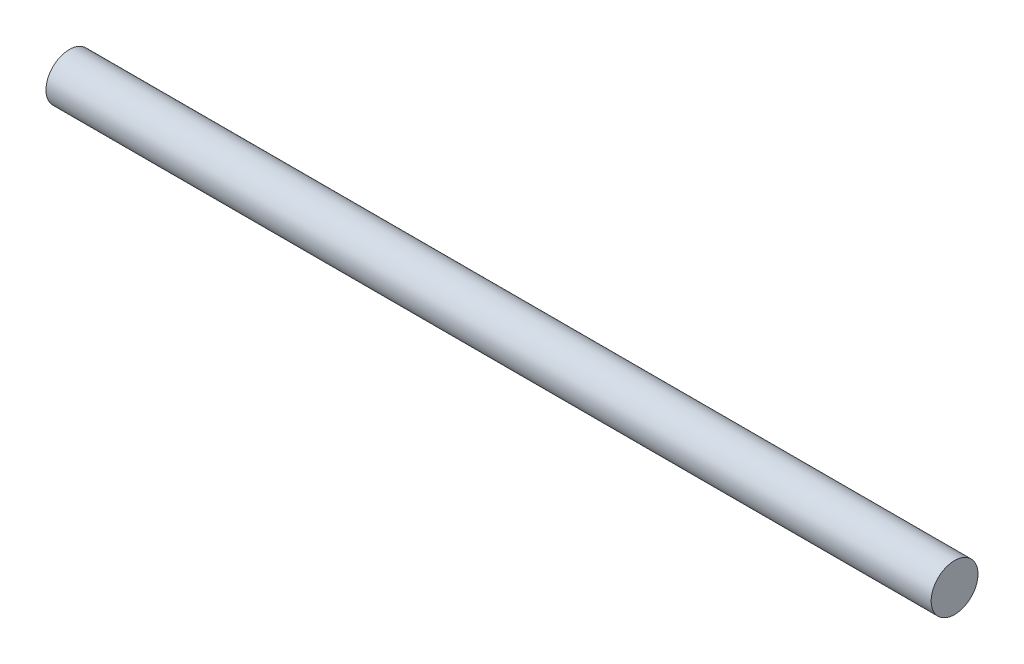
ISO-10303-21;
HEADER;
FILE_DESCRIPTION(('STEP AP214'),'2;1');
FILE_NAME('part.step','',(''),(''),'','','');
FILE_SCHEMA(('AUTOMOTIVE_DESIGN { 1 0 10303 214 1 1 1 1 }'));
ENDSEC;
DATA;
#1=APPLICATION_CONTEXT('core data for automotive mechanical design processes');
#2=APPLICATION_PROTOCOL_DEFINITION('international standard','automotive_design',2000,#1);
#3=PRODUCT_CONTEXT('',#1,'mechanical');
#4=PRODUCT('Part','Part','',(#3));
#5=PRODUCT_RELATED_PRODUCT_CATEGORY('part','',(#4));
#6=PRODUCT_DEFINITION_FORMATION('','',#4);
#7=PRODUCT_DEFINITION_CONTEXT('part definition',#1,'design');
#8=PRODUCT_DEFINITION('design','',#6,#7);
#9=PRODUCT_DEFINITION_SHAPE('','',#8);
#10=(LENGTH_UNIT() NAMED_UNIT(*) SI_UNIT(.MILLI.,.METRE.));
#11=(NAMED_UNIT(*) PLANE_ANGLE_UNIT() SI_UNIT($,.RADIAN.));
#12=(NAMED_UNIT(*) SI_UNIT($,.STERADIAN.) SOLID_ANGLE_UNIT());
#13=UNCERTAINTY_MEASURE_WITH_UNIT(LENGTH_MEASURE(1.E-05),#10,'distance_accuracy_value','');
#14=(GEOMETRIC_REPRESENTATION_CONTEXT(3) GLOBAL_UNCERTAINTY_ASSIGNED_CONTEXT((#13)) GLOBAL_UNIT_ASSIGNED_CONTEXT((#10,
#11,#12)) REPRESENTATION_CONTEXT('',''));
#15=CARTESIAN_POINT('',(0.,0.,0.));
#16=DIRECTION('',(0.,0.,1.));
#17=DIRECTION('',(1.,0.,0.));
#18=AXIS2_PLACEMENT_3D('',#15,#16,#17);
#19=CARTESIAN_POINT('',(30.,0.,0.));
#20=DIRECTION('',(-1.,0.,0.));
#21=DIRECTION('',(0.,0.,1.));
#22=AXIS2_PLACEMENT_3D('',#19,#20,#21);
#23=CYLINDRICAL_SURFACE('',#22,1.5875);
#24=CARTESIAN_POINT('',(30.,0.,0.));
#25=DIRECTION('',(1.,0.,0.));
#26=DIRECTION('',(0.,0.,-1.));
#27=AXIS2_PLACEMENT_3D('',#24,#25,#26);
#28=CIRCLE('',#27,1.5875);
#29=CARTESIAN_POINT('',(30.,0.,-1.5875));
#30=VERTEX_POINT('',#29);
#31=EDGE_CURVE('E10',#30,#30,#28,.T.);
#32=ORIENTED_EDGE('',*,*,#31,.F.);
#33=EDGE_LOOP('',(#32));
#34=FACE_BOUND('',#33,.T.);
#35=CARTESIAN_POINT('',(-30.,0.,0.));
#36=DIRECTION('',(1.,0.,0.));
#37=DIRECTION('',(0.,0.,-1.));
#38=AXIS2_PLACEMENT_3D('',#35,#36,#37);
#39=CIRCLE('',#38,1.5875);
#40=CARTESIAN_POINT('',(-30.,0.,-1.5875));
#41=VERTEX_POINT('',#40);
#42=EDGE_CURVE('E33',#41,#41,#39,.T.);
#43=ORIENTED_EDGE('',*,*,#42,.T.);
#44=EDGE_LOOP('',(#43));
#45=FACE_BOUND('',#44,.T.);
#46=ADVANCED_FACE('F30',(#34,#45),#23,.T.);
#47=CARTESIAN_POINT('',(30.,0.,0.));
#48=DIRECTION('',(1.,0.,0.));
#49=DIRECTION('',(0.,0.,-1.));
#50=AXIS2_PLACEMENT_3D('',#47,#48,#49);
#51=PLANE('',#50);
#52=ORIENTED_EDGE('',*,*,#31,.T.);
#53=EDGE_LOOP('',(#52));
#54=FACE_BOUND('',#53,.T.);
#55=ADVANCED_FACE('F45',(#54),#51,.T.);
#56=CARTESIAN_POINT('',(-30.,0.,0.));
#57=DIRECTION('',(1.,0.,0.));
#58=DIRECTION('',(0.,0.,-1.));
#59=AXIS2_PLACEMENT_3D('',#56,#57,#58);
#60=PLANE('',#59);
#61=ORIENTED_EDGE('',*,*,#42,.F.);
#62=EDGE_LOOP('',(#61));
#63=FACE_BOUND('',#62,.T.);
#64=ADVANCED_FACE('F43',(#63),#60,.F.);
#65=CLOSED_SHELL('',(#46,#55,#64));
#66=MANIFOLD_SOLID_BREP('B2',#65);
#67=ADVANCED_BREP_SHAPE_REPRESENTATION('',(#18,#66),#14);
#68=SHAPE_DEFINITION_REPRESENTATION(#9,#67);
ENDSEC;
END-ISO-10303-21;
